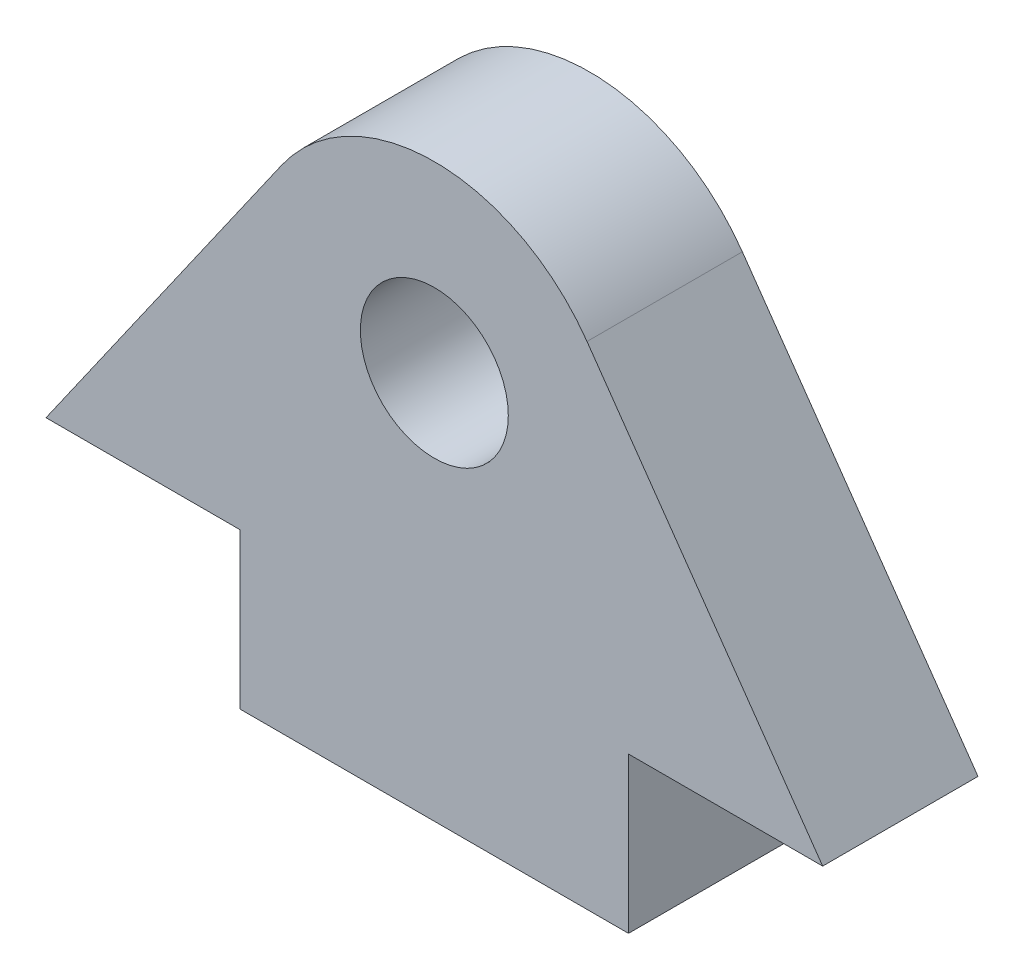
ISO-10303-21;
HEADER;
FILE_DESCRIPTION(('STEP AP214'),'2;1');
FILE_NAME('part.step','',(''),(''),'','','');
FILE_SCHEMA(('AUTOMOTIVE_DESIGN { 1 0 10303 214 1 1 1 1 }'));
ENDSEC;
DATA;
#1=APPLICATION_CONTEXT('core data for automotive mechanical design processes');
#2=APPLICATION_PROTOCOL_DEFINITION('international standard','automotive_design',2000,#1);
#3=PRODUCT_CONTEXT('',#1,'mechanical');
#4=PRODUCT('Part','Part','',(#3));
#5=PRODUCT_RELATED_PRODUCT_CATEGORY('part','',(#4));
#6=PRODUCT_DEFINITION_FORMATION('','',#4);
#7=PRODUCT_DEFINITION_CONTEXT('part definition',#1,'design');
#8=PRODUCT_DEFINITION('design','',#6,#7);
#9=PRODUCT_DEFINITION_SHAPE('','',#8);
#10=(LENGTH_UNIT() NAMED_UNIT(*) SI_UNIT(.MILLI.,.METRE.));
#11=(NAMED_UNIT(*) PLANE_ANGLE_UNIT() SI_UNIT($,.RADIAN.));
#12=(NAMED_UNIT(*) SI_UNIT($,.STERADIAN.) SOLID_ANGLE_UNIT());
#13=UNCERTAINTY_MEASURE_WITH_UNIT(LENGTH_MEASURE(1.E-05),#10,'distance_accuracy_value','');
#14=(GEOMETRIC_REPRESENTATION_CONTEXT(3) GLOBAL_UNCERTAINTY_ASSIGNED_CONTEXT((#13)) GLOBAL_UNIT_ASSIGNED_CONTEXT((#10,
#11,#12)) REPRESENTATION_CONTEXT('',''));
#15=CARTESIAN_POINT('',(0.,0.,0.));
#16=DIRECTION('',(0.,0.,1.));
#17=DIRECTION('',(1.,0.,0.));
#18=AXIS2_PLACEMENT_3D('',#15,#16,#17);
#19=CARTESIAN_POINT('',(33.5505035831418,23.4923155196477,10.));
#20=DIRECTION('',(-0.819152044288993,-0.573576436351044,0.));
#21=DIRECTION('',(0.573576436351044,-0.819152044288993,0.));
#22=AXIS2_PLACEMENT_3D('',#19,#20,#21);
#23=PLANE('',#22);
#24=DIRECTION('',(-0.573576436351044,0.819152044288993,0.));
#25=VECTOR('',#24,1.);
#26=CARTESIAN_POINT('',(33.5505035831418,23.4923155196477,0.));
#27=LINE('',#26,#25);
#28=CARTESIAN_POINT('',(50.,0.,0.));
#29=VERTEX_POINT('',#28);
#30=CARTESIAN_POINT('',(34.8298245314679,21.6652558573123,0.));
#31=VERTEX_POINT('',#30);
#32=EDGE_CURVE('E143',#29,#31,#27,.T.);
#33=ORIENTED_EDGE('',*,*,#32,.T.);
#34=DIRECTION('',(0.,0.,-1.));
#35=VECTOR('',#34,1.);
#36=CARTESIAN_POINT('',(34.8298245314679,21.6652558573123,10.));
#37=LINE('',#36,#35);
#38=CARTESIAN_POINT('',(34.8298245314679,21.6652558573123,10.));
#39=VERTEX_POINT('',#38);
#40=EDGE_CURVE('E43',#31,#39,#37,.F.);
#41=ORIENTED_EDGE('',*,*,#40,.T.);
#42=DIRECTION('',(-0.573576436351044,0.819152044288993,0.));
#43=VECTOR('',#42,1.);
#44=CARTESIAN_POINT('',(33.5505035831418,23.4923155196477,10.));
#45=LINE('',#44,#43);
#46=CARTESIAN_POINT('',(50.,0.,10.));
#47=VERTEX_POINT('',#46);
#48=EDGE_CURVE('E109',#47,#39,#45,.T.);
#49=ORIENTED_EDGE('',*,*,#48,.F.);
#50=DIRECTION('',(0.,0.,-1.));
#51=VECTOR('',#50,1.);
#52=CARTESIAN_POINT('',(50.,0.,10.));
#53=LINE('',#52,#51);
#54=EDGE_CURVE('E128',#47,#29,#53,.T.);
#55=ORIENTED_EDGE('',*,*,#54,.T.);
#56=EDGE_LOOP('',(#33,#41,#49,#55));
#57=FACE_BOUND('',#56,.T.);
#58=ADVANCED_FACE('F35',(#57),#23,.F.);
#59=CARTESIAN_POINT('',(0.,0.,10.));
#60=DIRECTION('',(0.819152044288993,-0.573576436351044,0.));
#61=DIRECTION('',(0.573576436351044,0.819152044288993,0.));
#62=AXIS2_PLACEMENT_3D('',#59,#60,#61);
#63=PLANE('',#62);
#64=DIRECTION('',(-0.573576436351044,-0.819152044288993,0.));
#65=VECTOR('',#64,1.);
#66=CARTESIAN_POINT('',(0.,0.,10.));
#67=LINE('',#66,#65);
#68=CARTESIAN_POINT('',(15.1701754685321,21.6652558573123,10.));
#69=VERTEX_POINT('',#68);
#70=CARTESIAN_POINT('',(0.,0.,10.));
#71=VERTEX_POINT('',#70);
#72=EDGE_CURVE('E99',#69,#71,#67,.T.);
#73=ORIENTED_EDGE('',*,*,#72,.F.);
#74=DIRECTION('',(0.,0.,-1.));
#75=VECTOR('',#74,1.);
#76=CARTESIAN_POINT('',(15.1701754685321,21.6652558573123,10.));
#77=LINE('',#76,#75);
#78=CARTESIAN_POINT('',(15.1701754685321,21.6652558573123,0.));
#79=VERTEX_POINT('',#78);
#80=EDGE_CURVE('E117',#69,#79,#77,.T.);
#81=ORIENTED_EDGE('',*,*,#80,.T.);
#82=DIRECTION('',(-0.573576436351044,-0.819152044288993,0.));
#83=VECTOR('',#82,1.);
#84=CARTESIAN_POINT('',(0.,0.,0.));
#85=LINE('',#84,#83);
#86=CARTESIAN_POINT('',(0.,0.,0.));
#87=VERTEX_POINT('',#86);
#88=EDGE_CURVE('E114',#79,#87,#85,.T.);
#89=ORIENTED_EDGE('',*,*,#88,.T.);
#90=DIRECTION('',(0.,0.,-1.));
#91=VECTOR('',#90,1.);
#92=CARTESIAN_POINT('',(0.,0.,10.));
#93=LINE('',#92,#91);
#94=EDGE_CURVE('E112',#71,#87,#93,.T.);
#95=ORIENTED_EDGE('',*,*,#94,.F.);
#96=EDGE_LOOP('',(#73,#81,#89,#95));
#97=FACE_BOUND('',#96,.T.);
#98=ADVANCED_FACE('F113',(#97),#63,.F.);
#99=CARTESIAN_POINT('',(0.,0.,10.));
#100=DIRECTION('',(0.,1.,0.));
#101=DIRECTION('',(0.,0.,1.));
#102=AXIS2_PLACEMENT_3D('',#99,#100,#101);
#103=PLANE('',#102);
#104=DIRECTION('',(1.,0.,0.));
#105=VECTOR('',#104,1.);
#106=CARTESIAN_POINT('',(0.,0.,0.));
#107=LINE('',#106,#105);
#108=CARTESIAN_POINT('',(12.5,0.,0.));
#109=VERTEX_POINT('',#108);
#110=EDGE_CURVE('E146',#87,#109,#107,.T.);
#111=ORIENTED_EDGE('',*,*,#110,.T.);
#112=DIRECTION('',(0.,0.,-1.));
#113=VECTOR('',#112,1.);
#114=CARTESIAN_POINT('',(12.5,0.,10.));
#115=LINE('',#114,#113);
#116=CARTESIAN_POINT('',(12.5,0.,10.));
#117=VERTEX_POINT('',#116);
#118=EDGE_CURVE('E118',#117,#109,#115,.T.);
#119=ORIENTED_EDGE('',*,*,#118,.F.);
#120=DIRECTION('',(1.,0.,0.));
#121=VECTOR('',#120,1.);
#122=CARTESIAN_POINT('',(0.,0.,10.));
#123=LINE('',#122,#121);
#124=EDGE_CURVE('E103',#71,#117,#123,.T.);
#125=ORIENTED_EDGE('',*,*,#124,.F.);
#126=ORIENTED_EDGE('',*,*,#94,.T.);
#127=EDGE_LOOP('',(#111,#119,#125,#126));
#128=FACE_BOUND('',#127,.T.);
#129=ADVANCED_FACE('F120',(#128),#103,.F.);
#130=CARTESIAN_POINT('',(12.5,0.,10.));
#131=DIRECTION('',(1.,0.,0.));
#132=DIRECTION('',(0.,0.,-1.));
#133=AXIS2_PLACEMENT_3D('',#130,#131,#132);
#134=PLANE('',#133);
#135=DIRECTION('',(0.,-1.,0.));
#136=VECTOR('',#135,1.);
#137=CARTESIAN_POINT('',(12.5,0.,0.));
#138=LINE('',#137,#136);
#139=CARTESIAN_POINT('',(12.5,-10.,0.));
#140=VERTEX_POINT('',#139);
#141=EDGE_CURVE('E148',#109,#140,#138,.T.);
#142=ORIENTED_EDGE('',*,*,#141,.T.);
#143=DIRECTION('',(0.,0.,-1.));
#144=VECTOR('',#143,1.);
#145=CARTESIAN_POINT('',(12.5,-10.,10.));
#146=LINE('',#145,#144);
#147=CARTESIAN_POINT('',(12.5,-10.,10.));
#148=VERTEX_POINT('',#147);
#149=EDGE_CURVE('E160',#148,#140,#146,.T.);
#150=ORIENTED_EDGE('',*,*,#149,.F.);
#151=DIRECTION('',(0.,-1.,0.));
#152=VECTOR('',#151,1.);
#153=CARTESIAN_POINT('',(12.5,0.,10.));
#154=LINE('',#153,#152);
#155=EDGE_CURVE('E123',#117,#148,#154,.T.);
#156=ORIENTED_EDGE('',*,*,#155,.F.);
#157=ORIENTED_EDGE('',*,*,#118,.T.);
#158=EDGE_LOOP('',(#142,#150,#156,#157));
#159=FACE_BOUND('',#158,.T.);
#160=ADVANCED_FACE('F170',(#159),#134,.F.);
#161=CARTESIAN_POINT('',(0.,-10.,10.));
#162=DIRECTION('',(0.,1.,0.));
#163=DIRECTION('',(0.,0.,1.));
#164=AXIS2_PLACEMENT_3D('',#161,#162,#163);
#165=PLANE('',#164);
#166=DIRECTION('',(1.,0.,0.));
#167=VECTOR('',#166,1.);
#168=CARTESIAN_POINT('',(0.,-10.,0.));
#169=LINE('',#168,#167);
#170=CARTESIAN_POINT('',(37.5,-10.,0.));
#171=VERTEX_POINT('',#170);
#172=EDGE_CURVE('E151',#140,#171,#169,.T.);
#173=ORIENTED_EDGE('',*,*,#172,.T.);
#174=DIRECTION('',(0.,0.,-1.));
#175=VECTOR('',#174,1.);
#176=CARTESIAN_POINT('',(37.5,-10.,10.));
#177=LINE('',#176,#175);
#178=CARTESIAN_POINT('',(37.5,-10.,10.));
#179=VERTEX_POINT('',#178);
#180=EDGE_CURVE('E157',#179,#171,#177,.T.);
#181=ORIENTED_EDGE('',*,*,#180,.F.);
#182=DIRECTION('',(1.,0.,0.));
#183=VECTOR('',#182,1.);
#184=CARTESIAN_POINT('',(0.,-10.,10.));
#185=LINE('',#184,#183);
#186=EDGE_CURVE('E126',#148,#179,#185,.T.);
#187=ORIENTED_EDGE('',*,*,#186,.F.);
#188=ORIENTED_EDGE('',*,*,#149,.T.);
#189=EDGE_LOOP('',(#173,#181,#187,#188));
#190=FACE_BOUND('',#189,.T.);
#191=ADVANCED_FACE('F175',(#190),#165,.F.);
#192=CARTESIAN_POINT('',(37.5,0.,10.));
#193=DIRECTION('',(-1.,0.,0.));
#194=DIRECTION('',(0.,0.,1.));
#195=AXIS2_PLACEMENT_3D('',#192,#193,#194);
#196=PLANE('',#195);
#197=DIRECTION('',(0.,1.,0.));
#198=VECTOR('',#197,1.);
#199=CARTESIAN_POINT('',(37.5,0.,0.));
#200=LINE('',#199,#198);
#201=CARTESIAN_POINT('',(37.5,0.,0.));
#202=VERTEX_POINT('',#201);
#203=EDGE_CURVE('E153',#171,#202,#200,.T.);
#204=ORIENTED_EDGE('',*,*,#203,.T.);
#205=DIRECTION('',(0.,0.,-1.));
#206=VECTOR('',#205,1.);
#207=CARTESIAN_POINT('',(37.5,0.,10.));
#208=LINE('',#207,#206);
#209=CARTESIAN_POINT('',(37.5,0.,10.));
#210=VERTEX_POINT('',#209);
#211=EDGE_CURVE('E133',#210,#202,#208,.T.);
#212=ORIENTED_EDGE('',*,*,#211,.F.);
#213=DIRECTION('',(0.,1.,0.));
#214=VECTOR('',#213,1.);
#215=CARTESIAN_POINT('',(37.5,0.,10.));
#216=LINE('',#215,#214);
#217=EDGE_CURVE('E129',#179,#210,#216,.T.);
#218=ORIENTED_EDGE('',*,*,#217,.F.);
#219=ORIENTED_EDGE('',*,*,#180,.T.);
#220=EDGE_LOOP('',(#204,#212,#218,#219));
#221=FACE_BOUND('',#220,.T.);
#222=ADVANCED_FACE('F178',(#221),#196,.F.);
#223=CARTESIAN_POINT('',(25.,15.,10.));
#224=DIRECTION('',(0.,0.,-1.));
#225=DIRECTION('',(-1.,0.,0.));
#226=AXIS2_PLACEMENT_3D('',#223,#224,#225);
#227=CYLINDRICAL_SURFACE('',#226,4.7625);
#228=CARTESIAN_POINT('',(25.,15.,10.));
#229=DIRECTION('',(0.,0.,1.));
#230=DIRECTION('',(1.,0.,0.));
#231=AXIS2_PLACEMENT_3D('',#228,#229,#230);
#232=CIRCLE('',#231,4.7625);
#233=CARTESIAN_POINT('',(29.7625,15.,10.));
#234=VERTEX_POINT('',#233);
#235=EDGE_CURVE('E182',#234,#234,#232,.T.);
#236=ORIENTED_EDGE('',*,*,#235,.T.);
#237=EDGE_LOOP('',(#236));
#238=FACE_BOUND('',#237,.T.);
#239=CARTESIAN_POINT('',(25.,15.,0.));
#240=DIRECTION('',(0.,0.,1.));
#241=DIRECTION('',(1.,0.,0.));
#242=AXIS2_PLACEMENT_3D('',#239,#240,#241);
#243=CIRCLE('',#242,4.7625);
#244=CARTESIAN_POINT('',(29.7625,15.,0.));
#245=VERTEX_POINT('',#244);
#246=EDGE_CURVE('E140',#245,#245,#243,.T.);
#247=ORIENTED_EDGE('',*,*,#246,.F.);
#248=EDGE_LOOP('',(#247));
#249=FACE_BOUND('',#248,.T.);
#250=ADVANCED_FACE('F188',(#238,#249),#227,.F.);
#251=EDGE_CURVE('E149',#202,#29,#107,.T.);
#252=ORIENTED_EDGE('',*,*,#251,.T.);
#253=ORIENTED_EDGE('',*,*,#54,.F.);
#254=EDGE_CURVE('E125',#210,#47,#123,.T.);
#255=ORIENTED_EDGE('',*,*,#254,.F.);
#256=ORIENTED_EDGE('',*,*,#211,.T.);
#257=EDGE_LOOP('',(#252,#253,#255,#256));
#258=FACE_BOUND('',#257,.T.);
#259=ADVANCED_FACE('F181',(#258),#103,.F.);
#260=CARTESIAN_POINT('',(0.,0.,10.));
#261=DIRECTION('',(0.,0.,1.));
#262=DIRECTION('',(1.,0.,0.));
#263=AXIS2_PLACEMENT_3D('',#260,#261,#262);
#264=PLANE('',#263);
#265=ORIENTED_EDGE('',*,*,#235,.F.);
#266=EDGE_LOOP('',(#265));
#267=FACE_BOUND('',#266,.T.);
#268=ORIENTED_EDGE('',*,*,#48,.T.);
#269=CARTESIAN_POINT('',(25.,14.7823386210998,10.));
#270=DIRECTION('',(0.,0.,1.));
#271=DIRECTION('',(1.,0.,0.));
#272=AXIS2_PLACEMENT_3D('',#269,#270,#271);
#273=CIRCLE('',#272,12.);
#274=EDGE_CURVE('E11',#39,#69,#273,.T.);
#275=ORIENTED_EDGE('',*,*,#274,.T.);
#276=ORIENTED_EDGE('',*,*,#72,.T.);
#277=ORIENTED_EDGE('',*,*,#124,.T.);
#278=ORIENTED_EDGE('',*,*,#155,.T.);
#279=ORIENTED_EDGE('',*,*,#186,.T.);
#280=ORIENTED_EDGE('',*,*,#217,.T.);
#281=ORIENTED_EDGE('',*,*,#254,.T.);
#282=EDGE_LOOP('',(#268,#275,#276,#277,#278,#279,#280,#281));
#283=FACE_BOUND('',#282,.T.);
#284=ADVANCED_FACE('F101',(#267,#283),#264,.T.);
#285=CARTESIAN_POINT('',(0.,0.,0.));
#286=DIRECTION('',(0.,0.,1.));
#287=DIRECTION('',(1.,0.,0.));
#288=AXIS2_PLACEMENT_3D('',#285,#286,#287);
#289=PLANE('',#288);
#290=ORIENTED_EDGE('',*,*,#246,.T.);
#291=EDGE_LOOP('',(#290));
#292=FACE_BOUND('',#291,.T.);
#293=ORIENTED_EDGE('',*,*,#88,.F.);
#294=CARTESIAN_POINT('',(25.,14.7823386210998,0.));
#295=DIRECTION('',(0.,0.,1.));
#296=DIRECTION('',(1.,0.,0.));
#297=AXIS2_PLACEMENT_3D('',#294,#295,#296);
#298=CIRCLE('',#297,12.);
#299=EDGE_CURVE('E57',#79,#31,#298,.F.);
#300=ORIENTED_EDGE('',*,*,#299,.T.);
#301=ORIENTED_EDGE('',*,*,#32,.F.);
#302=ORIENTED_EDGE('',*,*,#251,.F.);
#303=ORIENTED_EDGE('',*,*,#203,.F.);
#304=ORIENTED_EDGE('',*,*,#172,.F.);
#305=ORIENTED_EDGE('',*,*,#141,.F.);
#306=ORIENTED_EDGE('',*,*,#110,.F.);
#307=EDGE_LOOP('',(#293,#300,#301,#302,#303,#304,#305,#306));
#308=FACE_BOUND('',#307,.T.);
#309=ADVANCED_FACE('F166',(#292,#308),#289,.F.);
#310=CARTESIAN_POINT('',(25.,14.7823386210998,10.));
#311=DIRECTION('',(0.,0.,-1.));
#312=DIRECTION('',(-1.,0.,0.));
#313=AXIS2_PLACEMENT_3D('',#310,#311,#312);
#314=CYLINDRICAL_SURFACE('',#313,12.);
#315=ORIENTED_EDGE('',*,*,#274,.F.);
#316=ORIENTED_EDGE('',*,*,#40,.F.);
#317=ORIENTED_EDGE('',*,*,#299,.F.);
#318=ORIENTED_EDGE('',*,*,#80,.F.);
#319=EDGE_LOOP('',(#315,#316,#317,#318));
#320=FACE_BOUND('',#319,.T.);
#321=ADVANCED_FACE('F37',(#320),#314,.T.);
#322=CLOSED_SHELL('',(#58,#98,#129,#160,#191,#222,#250,#259,#284,#309,#321));
#323=MANIFOLD_SOLID_BREP('B2',#322);
#324=ADVANCED_BREP_SHAPE_REPRESENTATION('',(#18,#323),#14);
#325=SHAPE_DEFINITION_REPRESENTATION(#9,#324);
ENDSEC;
END-ISO-10303-21;
